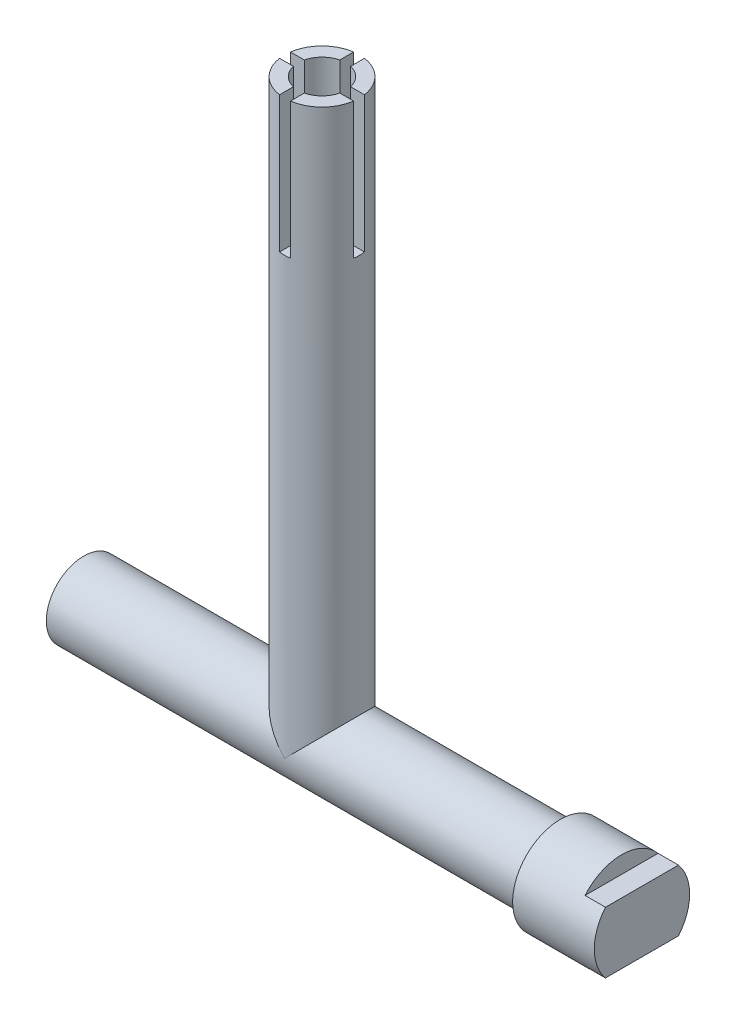
ISO-10303-21;
HEADER;
FILE_DESCRIPTION(('STEP AP214'),'2;1');
FILE_NAME('part.step','',(''),(''),'','','');
FILE_SCHEMA(('AUTOMOTIVE_DESIGN { 1 0 10303 214 1 1 1 1 }'));
ENDSEC;
DATA;
#1=APPLICATION_CONTEXT('core data for automotive mechanical design processes');
#2=APPLICATION_PROTOCOL_DEFINITION('international standard','automotive_design',2000,#1);
#3=PRODUCT_CONTEXT('',#1,'mechanical');
#4=PRODUCT('Part','Part','',(#3));
#5=PRODUCT_RELATED_PRODUCT_CATEGORY('part','',(#4));
#6=PRODUCT_DEFINITION_FORMATION('','',#4);
#7=PRODUCT_DEFINITION_CONTEXT('part definition',#1,'design');
#8=PRODUCT_DEFINITION('design','',#6,#7);
#9=PRODUCT_DEFINITION_SHAPE('','',#8);
#10=(LENGTH_UNIT() NAMED_UNIT(*) SI_UNIT(.MILLI.,.METRE.));
#11=(NAMED_UNIT(*) PLANE_ANGLE_UNIT() SI_UNIT($,.RADIAN.));
#12=(NAMED_UNIT(*) SI_UNIT($,.STERADIAN.) SOLID_ANGLE_UNIT());
#13=UNCERTAINTY_MEASURE_WITH_UNIT(LENGTH_MEASURE(1.E-05),#10,'distance_accuracy_value','');
#14=(GEOMETRIC_REPRESENTATION_CONTEXT(3) GLOBAL_UNCERTAINTY_ASSIGNED_CONTEXT((#13)) GLOBAL_UNIT_ASSIGNED_CONTEXT((#10,
#11,#12)) REPRESENTATION_CONTEXT('',''));
#15=CARTESIAN_POINT('',(0.,0.,0.));
#16=DIRECTION('',(0.,0.,1.));
#17=DIRECTION('',(1.,0.,0.));
#18=AXIS2_PLACEMENT_3D('',#15,#16,#17);
#19=CARTESIAN_POINT('',(41.,0.,0.));
#20=DIRECTION('',(-1.,0.,0.));
#21=DIRECTION('',(0.,0.,1.));
#22=AXIS2_PLACEMENT_3D('',#19,#20,#21);
#23=CYLINDRICAL_SURFACE('',#22,3.5);
#24=CARTESIAN_POINT('',(35.,0.,0.));
#25=DIRECTION('',(1.,0.,0.));
#26=DIRECTION('',(0.,0.,-1.));
#27=AXIS2_PLACEMENT_3D('',#24,#25,#26);
#28=CIRCLE('',#27,3.5);
#29=CARTESIAN_POINT('',(35.,0.,-3.5));
#30=VERTEX_POINT('',#29);
#31=EDGE_CURVE('E229',#30,#30,#28,.T.);
#32=ORIENTED_EDGE('',*,*,#31,.T.);
#33=EDGE_LOOP('',(#32));
#34=FACE_BOUND('',#33,.T.);
#35=DIRECTION('',(1.,0.,0.));
#36=VECTOR('',#35,1.);
#37=CARTESIAN_POINT('',(39.5,-2.25,2.6809513236909));
#38=LINE('',#37,#36);
#39=CARTESIAN_POINT('',(39.5,-2.25,2.6809513236909));
#40=VERTEX_POINT('',#39);
#41=CARTESIAN_POINT('',(41.,-2.25,2.6809513236909));
#42=VERTEX_POINT('',#41);
#43=EDGE_CURVE('E214',#40,#42,#38,.T.);
#44=ORIENTED_EDGE('',*,*,#43,.T.);
#45=CARTESIAN_POINT('',(41.,0.,0.));
#46=DIRECTION('',(1.,0.,0.));
#47=DIRECTION('',(0.,0.,-1.));
#48=AXIS2_PLACEMENT_3D('',#45,#46,#47);
#49=CIRCLE('',#48,3.5);
#50=CARTESIAN_POINT('',(41.,2.25,2.6809513236909));
#51=VERTEX_POINT('',#50);
#52=EDGE_CURVE('E231',#51,#42,#49,.T.);
#53=ORIENTED_EDGE('',*,*,#52,.F.);
#54=DIRECTION('',(1.,0.,0.));
#55=VECTOR('',#54,1.);
#56=CARTESIAN_POINT('',(39.5,2.25,2.6809513236909));
#57=LINE('',#56,#55);
#58=CARTESIAN_POINT('',(39.5,2.25,2.6809513236909));
#59=VERTEX_POINT('',#58);
#60=EDGE_CURVE('E61',#59,#51,#57,.T.);
#61=ORIENTED_EDGE('',*,*,#60,.F.);
#62=CARTESIAN_POINT('',(39.5,0.,0.));
#63=DIRECTION('',(1.,0.,0.));
#64=DIRECTION('',(0.,0.,-1.));
#65=AXIS2_PLACEMENT_3D('',#62,#63,#64);
#66=CIRCLE('',#65,3.5);
#67=CARTESIAN_POINT('',(39.5,2.25,-2.6809513236909));
#68=VERTEX_POINT('',#67);
#69=EDGE_CURVE('E220',#68,#59,#66,.T.);
#70=ORIENTED_EDGE('',*,*,#69,.F.);
#71=DIRECTION('',(1.,0.,0.));
#72=VECTOR('',#71,1.);
#73=CARTESIAN_POINT('',(39.5,2.25,-2.6809513236909));
#74=LINE('',#73,#72);
#75=CARTESIAN_POINT('',(41.,2.25,-2.6809513236909));
#76=VERTEX_POINT('',#75);
#77=EDGE_CURVE('E226',#68,#76,#74,.T.);
#78=ORIENTED_EDGE('',*,*,#77,.T.);
#79=CARTESIAN_POINT('',(41.,-2.25,-2.6809513236909));
#80=VERTEX_POINT('',#79);
#81=EDGE_CURVE('E235',#80,#76,#49,.T.);
#82=ORIENTED_EDGE('',*,*,#81,.F.);
#83=DIRECTION('',(1.,0.,0.));
#84=VECTOR('',#83,1.);
#85=CARTESIAN_POINT('',(39.5,-2.25,-2.6809513236909));
#86=LINE('',#85,#84);
#87=CARTESIAN_POINT('',(39.5,-2.25,-2.6809513236909));
#88=VERTEX_POINT('',#87);
#89=EDGE_CURVE('E53',#88,#80,#86,.T.);
#90=ORIENTED_EDGE('',*,*,#89,.F.);
#91=CARTESIAN_POINT('',(39.5,0.,0.));
#92=DIRECTION('',(1.,0.,0.));
#93=DIRECTION('',(0.,0.,-1.));
#94=AXIS2_PLACEMENT_3D('',#91,#92,#93);
#95=CIRCLE('',#94,3.5);
#96=EDGE_CURVE('E211',#40,#88,#95,.T.);
#97=ORIENTED_EDGE('',*,*,#96,.F.);
#98=EDGE_LOOP('',(#44,#53,#61,#70,#78,#82,#90,#97));
#99=FACE_BOUND('',#98,.T.);
#100=ADVANCED_FACE('F38',(#34,#99),#23,.T.);
#101=CARTESIAN_POINT('',(41.,0.,0.));
#102=DIRECTION('',(1.,0.,0.));
#103=DIRECTION('',(0.,0.,-1.));
#104=AXIS2_PLACEMENT_3D('',#101,#102,#103);
#105=PLANE('',#104);
#106=ORIENTED_EDGE('',*,*,#52,.T.);
#107=DIRECTION('',(0.,0.,-1.));
#108=VECTOR('',#107,1.);
#109=CARTESIAN_POINT('',(41.,-2.25,0.));
#110=LINE('',#109,#108);
#111=EDGE_CURVE('E207',#42,#80,#110,.T.);
#112=ORIENTED_EDGE('',*,*,#111,.T.);
#113=ORIENTED_EDGE('',*,*,#81,.T.);
#114=DIRECTION('',(0.,0.,-1.));
#115=VECTOR('',#114,1.);
#116=CARTESIAN_POINT('',(41.,2.25,0.));
#117=LINE('',#116,#115);
#118=EDGE_CURVE('E217',#51,#76,#117,.T.);
#119=ORIENTED_EDGE('',*,*,#118,.F.);
#120=EDGE_LOOP('',(#106,#112,#113,#119));
#121=FACE_BOUND('',#120,.T.);
#122=ADVANCED_FACE('F428',(#121),#105,.T.);
#123=CARTESIAN_POINT('',(17.5,42.,0.));
#124=DIRECTION('',(0.,-1.,0.));
#125=DIRECTION('',(0.,0.,-1.));
#126=AXIS2_PLACEMENT_3D('',#123,#124,#125);
#127=CYLINDRICAL_SURFACE('',#126,2.75);
#128=CARTESIAN_POINT('',(17.5,0.,0.));
#129=DIRECTION('',(-0.707106781186548,0.707106781186547,0.));
#130=DIRECTION('',(-0.707106781186548,-0.707106781186547,0.));
#131=AXIS2_PLACEMENT_3D('',#128,#129,#130);
#132=ELLIPSE('',#131,3.88908729652601,2.75);
#133=CARTESIAN_POINT('',(17.5,0.,2.75));
#134=VERTEX_POINT('',#133);
#135=CARTESIAN_POINT('',(17.5,0.,-2.75));
#136=VERTEX_POINT('',#135);
#137=EDGE_CURVE('E320',#134,#136,#132,.T.);
#138=ORIENTED_EDGE('',*,*,#137,.T.);
#139=CARTESIAN_POINT('',(17.5,0.,0.));
#140=DIRECTION('',(-0.707106781186548,-0.707106781186547,0.));
#141=DIRECTION('',(-0.707106781186548,0.707106781186547,0.));
#142=AXIS2_PLACEMENT_3D('',#139,#140,#141);
#143=ELLIPSE('',#142,3.88908729652601,2.75);
#144=EDGE_CURVE('E325',#136,#134,#143,.F.);
#145=ORIENTED_EDGE('',*,*,#144,.T.);
#146=EDGE_LOOP('',(#138,#145));
#147=FACE_BOUND('',#146,.T.);
#148=DIRECTION('',(0.,-1.,0.));
#149=VECTOR('',#148,1.);
#150=CARTESIAN_POINT('',(20.2207535720826,42.,-0.400000000000001));
#151=LINE('',#150,#149);
#152=CARTESIAN_POINT('',(20.2207535720826,32.,-0.400000000000018));
#153=VERTEX_POINT('',#152);
#154=CARTESIAN_POINT('',(20.2207535720826,42.,-0.400000000000001));
#155=VERTEX_POINT('',#154);
#156=EDGE_CURVE('E296',#153,#155,#151,.F.);
#157=ORIENTED_EDGE('',*,*,#156,.F.);
#158=CARTESIAN_POINT('',(17.5,32.,0.));
#159=DIRECTION('',(0.,1.,0.));
#160=DIRECTION('',(0.,0.,1.));
#161=AXIS2_PLACEMENT_3D('',#158,#159,#160);
#162=CIRCLE('',#161,2.75);
#163=CARTESIAN_POINT('',(20.2207535720826,32.,0.39999999999998));
#164=VERTEX_POINT('',#163);
#165=EDGE_CURVE('E282',#164,#153,#162,.T.);
#166=ORIENTED_EDGE('',*,*,#165,.F.);
#167=DIRECTION('',(0.,-1.,0.));
#168=VECTOR('',#167,1.);
#169=CARTESIAN_POINT('',(20.2207535720826,42.,0.399999999999998));
#170=LINE('',#169,#168);
#171=CARTESIAN_POINT('',(20.2207535720826,42.,0.399999999999998));
#172=VERTEX_POINT('',#171);
#173=EDGE_CURVE('E293',#164,#172,#170,.F.);
#174=ORIENTED_EDGE('',*,*,#173,.T.);
#175=CARTESIAN_POINT('',(17.5,42.,0.));
#176=DIRECTION('',(0.,1.,0.));
#177=DIRECTION('',(0.,0.,1.));
#178=AXIS2_PLACEMENT_3D('',#175,#176,#177);
#179=CIRCLE('',#178,2.75);
#180=CARTESIAN_POINT('',(17.9,42.0000000000001,2.72075357208256));
#181=VERTEX_POINT('',#180);
#182=EDGE_CURVE('E312',#181,#172,#179,.T.);
#183=ORIENTED_EDGE('',*,*,#182,.F.);
#184=DIRECTION('',(0.,-1.,0.));
#185=VECTOR('',#184,1.);
#186=CARTESIAN_POINT('',(17.9,42.0000000000001,2.72075357208255));
#187=LINE('',#186,#185);
#188=CARTESIAN_POINT('',(17.9,32.0000000000001,2.72075357208256));
#189=VERTEX_POINT('',#188);
#190=EDGE_CURVE('E290',#181,#189,#187,.T.);
#191=ORIENTED_EDGE('',*,*,#190,.T.);
#192=CARTESIAN_POINT('',(17.1,32.0000000000001,2.72075357208256));
#193=VERTEX_POINT('',#192);
#194=EDGE_CURVE('E261',#193,#189,#162,.T.);
#195=ORIENTED_EDGE('',*,*,#194,.F.);
#196=DIRECTION('',(0.,-1.,0.));
#197=VECTOR('',#196,1.);
#198=CARTESIAN_POINT('',(17.1,42.,2.72075357208255));
#199=LINE('',#198,#197);
#200=CARTESIAN_POINT('',(17.1,42.,2.72075357208255));
#201=VERTEX_POINT('',#200);
#202=EDGE_CURVE('E288',#201,#193,#199,.T.);
#203=ORIENTED_EDGE('',*,*,#202,.F.);
#204=CARTESIAN_POINT('',(14.7792464279174,42.0000000000001,0.399999999999998));
#205=VERTEX_POINT('',#204);
#206=EDGE_CURVE('E311',#205,#201,#179,.T.);
#207=ORIENTED_EDGE('',*,*,#206,.F.);
#208=DIRECTION('',(0.,-1.,0.));
#209=VECTOR('',#208,1.);
#210=CARTESIAN_POINT('',(14.7792464279174,42.0000000000001,0.399999999999998));
#211=LINE('',#210,#209);
#212=CARTESIAN_POINT('',(14.7792464279174,32.,0.39999999999998));
#213=VERTEX_POINT('',#212);
#214=EDGE_CURVE('E285',#205,#213,#211,.T.);
#215=ORIENTED_EDGE('',*,*,#214,.T.);
#216=CARTESIAN_POINT('',(14.7792464279174,32.,-0.400000000000018));
#217=VERTEX_POINT('',#216);
#218=EDGE_CURVE('E281',#217,#213,#162,.T.);
#219=ORIENTED_EDGE('',*,*,#218,.F.);
#220=DIRECTION('',(0.,-1.,0.));
#221=VECTOR('',#220,1.);
#222=CARTESIAN_POINT('',(14.7792464279174,42.0000000000001,-0.400000000000001));
#223=LINE('',#222,#221);
#224=CARTESIAN_POINT('',(14.7792464279174,42.0000000000001,-0.400000000000001));
#225=VERTEX_POINT('',#224);
#226=EDGE_CURVE('E283',#225,#217,#223,.T.);
#227=ORIENTED_EDGE('',*,*,#226,.F.);
#228=CARTESIAN_POINT('',(17.1,42.,-2.72075357208255));
#229=VERTEX_POINT('',#228);
#230=EDGE_CURVE('E395',#229,#225,#179,.T.);
#231=ORIENTED_EDGE('',*,*,#230,.F.);
#232=DIRECTION('',(0.,-1.,0.));
#233=VECTOR('',#232,1.);
#234=CARTESIAN_POINT('',(17.1,42.,-2.72075357208255));
#235=LINE('',#234,#233);
#236=CARTESIAN_POINT('',(17.1,32.,-2.72075357208256));
#237=VERTEX_POINT('',#236);
#238=EDGE_CURVE('E301',#237,#229,#235,.F.);
#239=ORIENTED_EDGE('',*,*,#238,.F.);
#240=CARTESIAN_POINT('',(17.9,32.,-2.72075357208256));
#241=VERTEX_POINT('',#240);
#242=EDGE_CURVE('E380',#241,#237,#162,.T.);
#243=ORIENTED_EDGE('',*,*,#242,.F.);
#244=DIRECTION('',(0.,-1.,0.));
#245=VECTOR('',#244,1.);
#246=CARTESIAN_POINT('',(17.9,42.0000000000001,-2.72075357208255));
#247=LINE('',#246,#245);
#248=CARTESIAN_POINT('',(17.9,42.0000000000001,-2.72075357208255));
#249=VERTEX_POINT('',#248);
#250=EDGE_CURVE('E298',#241,#249,#247,.F.);
#251=ORIENTED_EDGE('',*,*,#250,.T.);
#252=EDGE_CURVE('E316',#155,#249,#179,.T.);
#253=ORIENTED_EDGE('',*,*,#252,.F.);
#254=EDGE_LOOP('',(#157,#166,#174,#183,#191,#195,#203,#207,#215,#219,#227,#231,#239,#243,#251,#253));
#255=FACE_BOUND('',#254,.T.);
#256=ADVANCED_FACE('F378',(#147,#255),#127,.T.);
#257=CARTESIAN_POINT('',(17.5,42.,0.));
#258=DIRECTION('',(0.,1.,0.));
#259=DIRECTION('',(0.,0.,1.));
#260=AXIS2_PLACEMENT_3D('',#257,#258,#259);
#261=PLANE('',#260);
#262=CARTESIAN_POINT('',(17.5,42.,0.));
#263=DIRECTION('',(0.,1.,0.));
#264=DIRECTION('',(0.,0.,1.));
#265=AXIS2_PLACEMENT_3D('',#262,#263,#264);
#266=CIRCLE('',#265,1.75);
#267=CARTESIAN_POINT('',(17.1,42.,-1.70367250374007));
#268=VERTEX_POINT('',#267);
#269=CARTESIAN_POINT('',(15.7963274962599,42.0000000000001,-0.400000000000001));
#270=VERTEX_POINT('',#269);
#271=EDGE_CURVE('E779',#268,#270,#266,.T.);
#272=ORIENTED_EDGE('',*,*,#271,.F.);
#273=DIRECTION('',(0.,0.,-1.));
#274=VECTOR('',#273,1.);
#275=CARTESIAN_POINT('',(17.1,42.,0.));
#276=LINE('',#275,#274);
#277=EDGE_CURVE('E234',#268,#229,#276,.T.);
#278=ORIENTED_EDGE('',*,*,#277,.T.);
#279=ORIENTED_EDGE('',*,*,#230,.T.);
#280=DIRECTION('',(1.,0.,0.));
#281=VECTOR('',#280,1.);
#282=CARTESIAN_POINT('',(0.,42.,-0.400000000000015));
#283=LINE('',#282,#281);
#284=EDGE_CURVE('E264',#225,#270,#283,.T.);
#285=ORIENTED_EDGE('',*,*,#284,.T.);
#286=EDGE_LOOP('',(#272,#278,#279,#285));
#287=FACE_BOUND('',#286,.T.);
#288=ADVANCED_FACE('F482',(#287),#261,.T.);
#289=DIRECTION('',(0.,0.,-1.));
#290=VECTOR('',#289,1.);
#291=CARTESIAN_POINT('',(17.9,42.0000000000001,0.));
#292=LINE('',#291,#290);
#293=CARTESIAN_POINT('',(17.9,42.0000000000001,-1.70367250374008));
#294=VERTEX_POINT('',#293);
#295=EDGE_CURVE('E242',#294,#249,#292,.T.);
#296=ORIENTED_EDGE('',*,*,#295,.F.);
#297=CARTESIAN_POINT('',(19.2036725037401,42.,-0.400000000000001));
#298=VERTEX_POINT('',#297);
#299=EDGE_CURVE('E308',#298,#294,#266,.T.);
#300=ORIENTED_EDGE('',*,*,#299,.F.);
#301=DIRECTION('',(1.,0.,0.));
#302=VECTOR('',#301,1.);
#303=CARTESIAN_POINT('',(0.,42.,-0.400000000000015));
#304=LINE('',#303,#302);
#305=EDGE_CURVE('E276',#298,#155,#304,.T.);
#306=ORIENTED_EDGE('',*,*,#305,.T.);
#307=ORIENTED_EDGE('',*,*,#252,.T.);
#308=EDGE_LOOP('',(#296,#300,#306,#307));
#309=FACE_BOUND('',#308,.T.);
#310=ADVANCED_FACE('F402',(#309),#261,.T.);
#311=ORIENTED_EDGE('',*,*,#206,.T.);
#312=DIRECTION('',(0.,0.,-1.));
#313=VECTOR('',#312,1.);
#314=CARTESIAN_POINT('',(17.1,42.,0.));
#315=LINE('',#314,#313);
#316=CARTESIAN_POINT('',(17.1,42.,1.70367250374008));
#317=VERTEX_POINT('',#316);
#318=EDGE_CURVE('E269',#201,#317,#315,.T.);
#319=ORIENTED_EDGE('',*,*,#318,.T.);
#320=CARTESIAN_POINT('',(15.7963274962599,42.0000000000001,0.399999999999998));
#321=VERTEX_POINT('',#320);
#322=EDGE_CURVE('E303',#321,#317,#266,.T.);
#323=ORIENTED_EDGE('',*,*,#322,.F.);
#324=DIRECTION('',(1.,0.,0.));
#325=VECTOR('',#324,1.);
#326=CARTESIAN_POINT('',(0.,42.,0.399999999999984));
#327=LINE('',#326,#325);
#328=EDGE_CURVE('E267',#205,#321,#327,.T.);
#329=ORIENTED_EDGE('',*,*,#328,.F.);
#330=EDGE_LOOP('',(#311,#319,#323,#329));
#331=FACE_BOUND('',#330,.T.);
#332=ADVANCED_FACE('F491',(#331),#261,.T.);
#333=CARTESIAN_POINT('',(17.5,42.,0.));
#334=DIRECTION('',(0.,1.,0.));
#335=DIRECTION('',(0.,0.,1.));
#336=AXIS2_PLACEMENT_3D('',#333,#334,#335);
#337=CYLINDRICAL_SURFACE('',#336,1.75);
#338=CARTESIAN_POINT('',(17.5,32.,0.));
#339=DIRECTION('',(0.,1.,0.));
#340=DIRECTION('',(0.,0.,1.));
#341=AXIS2_PLACEMENT_3D('',#338,#339,#340);
#342=CIRCLE('',#341,1.75);
#343=CARTESIAN_POINT('',(15.7963274962599,32.,0.39999999999998));
#344=VERTEX_POINT('',#343);
#345=CARTESIAN_POINT('',(15.7963274962599,32.,-0.400000000000018));
#346=VERTEX_POINT('',#345);
#347=EDGE_CURVE('E331',#344,#346,#342,.F.);
#348=ORIENTED_EDGE('',*,*,#347,.F.);
#349=DIRECTION('',(0.,1.,0.));
#350=VECTOR('',#349,1.);
#351=CARTESIAN_POINT('',(15.7963274962599,42.0000000000001,0.399999999999998));
#352=LINE('',#351,#350);
#353=EDGE_CURVE('E11',#344,#321,#352,.T.);
#354=ORIENTED_EDGE('',*,*,#353,.T.);
#355=ORIENTED_EDGE('',*,*,#322,.T.);
#356=DIRECTION('',(0.,1.,0.));
#357=VECTOR('',#356,1.);
#358=CARTESIAN_POINT('',(17.1,42.,1.70367250374008));
#359=LINE('',#358,#357);
#360=CARTESIAN_POINT('',(17.1,32.,1.70367250374008));
#361=VERTEX_POINT('',#360);
#362=EDGE_CURVE('E330',#361,#317,#359,.T.);
#363=ORIENTED_EDGE('',*,*,#362,.F.);
#364=CARTESIAN_POINT('',(17.9,32.,1.70367250374008));
#365=VERTEX_POINT('',#364);
#366=EDGE_CURVE('E328',#365,#361,#342,.F.);
#367=ORIENTED_EDGE('',*,*,#366,.F.);
#368=DIRECTION('',(0.,1.,0.));
#369=VECTOR('',#368,1.);
#370=CARTESIAN_POINT('',(17.9,42.0000000000001,1.70367250374008));
#371=LINE('',#370,#369);
#372=CARTESIAN_POINT('',(17.9,42.0000000000001,1.70367250374008));
#373=VERTEX_POINT('',#372);
#374=EDGE_CURVE('E334',#365,#373,#371,.T.);
#375=ORIENTED_EDGE('',*,*,#374,.T.);
#376=CARTESIAN_POINT('',(19.2036725037401,42.,0.399999999999998));
#377=VERTEX_POINT('',#376);
#378=EDGE_CURVE('E304',#373,#377,#266,.T.);
#379=ORIENTED_EDGE('',*,*,#378,.T.);
#380=DIRECTION('',(0.,1.,0.));
#381=VECTOR('',#380,1.);
#382=CARTESIAN_POINT('',(19.2036725037401,42.,0.399999999999998));
#383=LINE('',#382,#381);
#384=CARTESIAN_POINT('',(19.2036725037401,32.,0.39999999999998));
#385=VERTEX_POINT('',#384);
#386=EDGE_CURVE('E337',#377,#385,#383,.F.);
#387=ORIENTED_EDGE('',*,*,#386,.T.);
#388=CARTESIAN_POINT('',(19.2036725037401,32.,-0.400000000000018));
#389=VERTEX_POINT('',#388);
#390=EDGE_CURVE('E332',#389,#385,#342,.F.);
#391=ORIENTED_EDGE('',*,*,#390,.F.);
#392=DIRECTION('',(0.,1.,0.));
#393=VECTOR('',#392,1.);
#394=CARTESIAN_POINT('',(19.2036725037401,42.,-0.400000000000001));
#395=LINE('',#394,#393);
#396=EDGE_CURVE('E340',#298,#389,#395,.F.);
#397=ORIENTED_EDGE('',*,*,#396,.F.);
#398=ORIENTED_EDGE('',*,*,#299,.T.);
#399=DIRECTION('',(0.,1.,0.));
#400=VECTOR('',#399,1.);
#401=CARTESIAN_POINT('',(17.9,42.0000000000001,-1.70367250374008));
#402=LINE('',#401,#400);
#403=CARTESIAN_POINT('',(17.9,32.,-1.70367250374008));
#404=VERTEX_POINT('',#403);
#405=EDGE_CURVE('E344',#294,#404,#402,.F.);
#406=ORIENTED_EDGE('',*,*,#405,.T.);
#407=CARTESIAN_POINT('',(17.1,32.,-1.70367250374008));
#408=VERTEX_POINT('',#407);
#409=EDGE_CURVE('E343',#408,#404,#342,.F.);
#410=ORIENTED_EDGE('',*,*,#409,.F.);
#411=DIRECTION('',(0.,1.,0.));
#412=VECTOR('',#411,1.);
#413=CARTESIAN_POINT('',(17.1,42.,-1.70367250374007));
#414=LINE('',#413,#412);
#415=EDGE_CURVE('E347',#268,#408,#414,.F.);
#416=ORIENTED_EDGE('',*,*,#415,.F.);
#417=ORIENTED_EDGE('',*,*,#271,.T.);
#418=DIRECTION('',(0.,1.,0.));
#419=VECTOR('',#418,1.);
#420=CARTESIAN_POINT('',(15.7963274962599,42.0000000000001,-0.400000000000001));
#421=LINE('',#420,#419);
#422=EDGE_CURVE('E46',#346,#270,#421,.T.);
#423=ORIENTED_EDGE('',*,*,#422,.F.);
#424=EDGE_LOOP('',(#348,#354,#355,#363,#367,#375,#379,#387,#391,#397,#398,#406,#410,#416,#417,#423));
#425=FACE_BOUND('',#424,.T.);
#426=CARTESIAN_POINT('',(17.5,28.9999999999999,0.));
#427=DIRECTION('',(0.,1.,0.));
#428=DIRECTION('',(0.,0.,1.));
#429=AXIS2_PLACEMENT_3D('',#426,#427,#428);
#430=CIRCLE('',#429,1.75);
#431=CARTESIAN_POINT('',(17.5,28.9999999999999,1.75));
#432=VERTEX_POINT('',#431);
#433=EDGE_CURVE('E307',#432,#432,#430,.T.);
#434=ORIENTED_EDGE('',*,*,#433,.F.);
#435=EDGE_LOOP('',(#434));
#436=FACE_BOUND('',#435,.T.);
#437=ADVANCED_FACE('F367',(#425,#436),#337,.F.);
#438=CARTESIAN_POINT('',(35.,0.,0.));
#439=DIRECTION('',(-1.,0.,0.));
#440=DIRECTION('',(0.,0.,1.));
#441=AXIS2_PLACEMENT_3D('',#438,#439,#440);
#442=CYLINDRICAL_SURFACE('',#441,2.75);
#443=CARTESIAN_POINT('',(0.,0.,0.));
#444=DIRECTION('',(1.,0.,0.));
#445=DIRECTION('',(0.,0.,-1.));
#446=AXIS2_PLACEMENT_3D('',#443,#444,#445);
#447=CIRCLE('',#446,2.75);
#448=CARTESIAN_POINT('',(0.,0.,-2.75));
#449=VERTEX_POINT('',#448);
#450=EDGE_CURVE('E315',#449,#449,#447,.T.);
#451=ORIENTED_EDGE('',*,*,#450,.T.);
#452=EDGE_LOOP('',(#451));
#453=FACE_BOUND('',#452,.T.);
#454=CARTESIAN_POINT('',(35.,0.,0.));
#455=DIRECTION('',(1.,0.,0.));
#456=DIRECTION('',(0.,0.,-1.));
#457=AXIS2_PLACEMENT_3D('',#454,#455,#456);
#458=CIRCLE('',#457,2.75);
#459=CARTESIAN_POINT('',(35.,0.,-2.75));
#460=VERTEX_POINT('',#459);
#461=EDGE_CURVE('E317',#460,#460,#458,.T.);
#462=ORIENTED_EDGE('',*,*,#461,.F.);
#463=EDGE_LOOP('',(#462));
#464=FACE_BOUND('',#463,.T.);
#465=ORIENTED_EDGE('',*,*,#144,.F.);
#466=ORIENTED_EDGE('',*,*,#137,.F.);
#467=EDGE_LOOP('',(#465,#466));
#468=FACE_BOUND('',#467,.T.);
#469=ADVANCED_FACE('F40',(#453,#464,#468),#442,.T.);
#470=CARTESIAN_POINT('',(0.,0.,0.));
#471=DIRECTION('',(1.,0.,0.));
#472=DIRECTION('',(0.,0.,-1.));
#473=AXIS2_PLACEMENT_3D('',#470,#471,#472);
#474=PLANE('',#473);
#475=CARTESIAN_POINT('',(0.,0.,0.));
#476=DIRECTION('',(-1.,0.,0.));
#477=DIRECTION('',(0.,0.,1.));
#478=AXIS2_PLACEMENT_3D('',#475,#476,#477);
#479=CIRCLE('',#478,2.);
#480=CARTESIAN_POINT('',(0.,0.,2.));
#481=VERTEX_POINT('',#480);
#482=EDGE_CURVE('E197',#481,#481,#479,.T.);
#483=ORIENTED_EDGE('',*,*,#482,.F.);
#484=EDGE_LOOP('',(#483));
#485=FACE_BOUND('',#484,.T.);
#486=ORIENTED_EDGE('',*,*,#450,.F.);
#487=EDGE_LOOP('',(#486));
#488=FACE_BOUND('',#487,.T.);
#489=ADVANCED_FACE('F471',(#485,#488),#474,.F.);
#490=DIRECTION('',(1.,0.,0.));
#491=VECTOR('',#490,1.);
#492=CARTESIAN_POINT('',(0.,42.,0.399999999999984));
#493=LINE('',#492,#491);
#494=EDGE_CURVE('E274',#377,#172,#493,.T.);
#495=ORIENTED_EDGE('',*,*,#494,.F.);
#496=ORIENTED_EDGE('',*,*,#378,.F.);
#497=DIRECTION('',(0.,0.,-1.));
#498=VECTOR('',#497,1.);
#499=CARTESIAN_POINT('',(17.9,42.0000000000001,0.));
#500=LINE('',#499,#498);
#501=EDGE_CURVE('E272',#181,#373,#500,.T.);
#502=ORIENTED_EDGE('',*,*,#501,.F.);
#503=ORIENTED_EDGE('',*,*,#182,.T.);
#504=EDGE_LOOP('',(#495,#496,#502,#503));
#505=FACE_BOUND('',#504,.T.);
#506=ADVANCED_FACE('F374',(#505),#261,.T.);
#507=CARTESIAN_POINT('',(17.5,28.9999999999999,0.));
#508=DIRECTION('',(0.,1.,0.));
#509=DIRECTION('',(0.,0.,1.));
#510=AXIS2_PLACEMENT_3D('',#507,#508,#509);
#511=CONICAL_SURFACE('',#510,1.75,1.02974425867665);
#512=CARTESIAN_POINT('',(17.5,27.9484939167017,0.));
#513=VERTEX_POINT('',#512);
#514=VERTEX_LOOP('',#513);
#515=FACE_BOUND('',#514,.T.);
#516=ORIENTED_EDGE('',*,*,#433,.T.);
#517=EDGE_LOOP('',(#516));
#518=FACE_BOUND('',#517,.T.);
#519=ADVANCED_FACE('F490',(#515,#518),#511,.F.);
#520=CARTESIAN_POINT('',(0.,32.,0.));
#521=DIRECTION('',(0.,1.,0.));
#522=DIRECTION('',(0.,0.,1.));
#523=AXIS2_PLACEMENT_3D('',#520,#521,#522);
#524=PLANE('',#523);
#525=ORIENTED_EDGE('',*,*,#194,.T.);
#526=DIRECTION('',(0.,0.,-1.));
#527=VECTOR('',#526,1.);
#528=CARTESIAN_POINT('',(17.9,32.,0.));
#529=LINE('',#528,#527);
#530=EDGE_CURVE('E250',#189,#365,#529,.T.);
#531=ORIENTED_EDGE('',*,*,#530,.T.);
#532=ORIENTED_EDGE('',*,*,#366,.T.);
#533=DIRECTION('',(0.,0.,-1.));
#534=VECTOR('',#533,1.);
#535=CARTESIAN_POINT('',(17.1,32.,0.));
#536=LINE('',#535,#534);
#537=EDGE_CURVE('E247',#193,#361,#536,.T.);
#538=ORIENTED_EDGE('',*,*,#537,.F.);
#539=EDGE_LOOP('',(#525,#531,#532,#538));
#540=FACE_BOUND('',#539,.T.);
#541=ADVANCED_FACE('F424',(#540),#524,.T.);
#542=CARTESIAN_POINT('',(17.1,32.,0.));
#543=DIRECTION('',(1.,0.,0.));
#544=DIRECTION('',(0.,0.,-1.));
#545=AXIS2_PLACEMENT_3D('',#542,#543,#544);
#546=PLANE('',#545);
#547=ORIENTED_EDGE('',*,*,#202,.T.);
#548=ORIENTED_EDGE('',*,*,#537,.T.);
#549=ORIENTED_EDGE('',*,*,#362,.T.);
#550=ORIENTED_EDGE('',*,*,#318,.F.);
#551=EDGE_LOOP('',(#547,#548,#549,#550));
#552=FACE_BOUND('',#551,.T.);
#553=ADVANCED_FACE('F504',(#552),#546,.T.);
#554=CARTESIAN_POINT('',(17.9,32.,0.));
#555=DIRECTION('',(1.,0.,0.));
#556=DIRECTION('',(0.,0.,-1.));
#557=AXIS2_PLACEMENT_3D('',#554,#555,#556);
#558=PLANE('',#557);
#559=ORIENTED_EDGE('',*,*,#501,.T.);
#560=ORIENTED_EDGE('',*,*,#374,.F.);
#561=ORIENTED_EDGE('',*,*,#530,.F.);
#562=ORIENTED_EDGE('',*,*,#190,.F.);
#563=EDGE_LOOP('',(#559,#560,#561,#562));
#564=FACE_BOUND('',#563,.T.);
#565=ADVANCED_FACE('F426',(#564),#558,.F.);
#566=ORIENTED_EDGE('',*,*,#165,.T.);
#567=DIRECTION('',(1.,0.,0.));
#568=VECTOR('',#567,1.);
#569=CARTESIAN_POINT('',(0.,32.,-0.400000000000018));
#570=LINE('',#569,#568);
#571=EDGE_CURVE('E255',#389,#153,#570,.T.);
#572=ORIENTED_EDGE('',*,*,#571,.F.);
#573=ORIENTED_EDGE('',*,*,#390,.T.);
#574=DIRECTION('',(1.,0.,0.));
#575=VECTOR('',#574,1.);
#576=CARTESIAN_POINT('',(0.,32.,0.39999999999998));
#577=LINE('',#576,#575);
#578=EDGE_CURVE('E252',#385,#164,#577,.T.);
#579=ORIENTED_EDGE('',*,*,#578,.T.);
#580=EDGE_LOOP('',(#566,#572,#573,#579));
#581=FACE_BOUND('',#580,.T.);
#582=ADVANCED_FACE('F360',(#581),#524,.T.);
#583=CARTESIAN_POINT('',(0.,32.,0.39999999999998));
#584=DIRECTION('',(0.,0.,1.));
#585=DIRECTION('',(1.,0.,0.));
#586=AXIS2_PLACEMENT_3D('',#583,#584,#585);
#587=PLANE('',#586);
#588=ORIENTED_EDGE('',*,*,#578,.F.);
#589=ORIENTED_EDGE('',*,*,#386,.F.);
#590=ORIENTED_EDGE('',*,*,#494,.T.);
#591=ORIENTED_EDGE('',*,*,#173,.F.);
#592=EDGE_LOOP('',(#588,#589,#590,#591));
#593=FACE_BOUND('',#592,.T.);
#594=ADVANCED_FACE('F365',(#593),#587,.F.);
#595=CARTESIAN_POINT('',(0.,32.,-0.400000000000018));
#596=DIRECTION('',(0.,0.,1.));
#597=DIRECTION('',(1.,0.,0.));
#598=AXIS2_PLACEMENT_3D('',#595,#596,#597);
#599=PLANE('',#598);
#600=ORIENTED_EDGE('',*,*,#156,.T.);
#601=ORIENTED_EDGE('',*,*,#305,.F.);
#602=ORIENTED_EDGE('',*,*,#396,.T.);
#603=ORIENTED_EDGE('',*,*,#571,.T.);
#604=EDGE_LOOP('',(#600,#601,#602,#603));
#605=FACE_BOUND('',#604,.T.);
#606=ADVANCED_FACE('F410',(#605),#599,.T.);
#607=ORIENTED_EDGE('',*,*,#242,.T.);
#608=DIRECTION('',(0.,0.,-1.));
#609=VECTOR('',#608,1.);
#610=CARTESIAN_POINT('',(17.1,32.,0.));
#611=LINE('',#610,#609);
#612=EDGE_CURVE('E238',#408,#237,#611,.T.);
#613=ORIENTED_EDGE('',*,*,#612,.F.);
#614=ORIENTED_EDGE('',*,*,#409,.T.);
#615=DIRECTION('',(0.,0.,-1.));
#616=VECTOR('',#615,1.);
#617=CARTESIAN_POINT('',(17.9,32.,0.));
#618=LINE('',#617,#616);
#619=EDGE_CURVE('E258',#404,#241,#618,.T.);
#620=ORIENTED_EDGE('',*,*,#619,.T.);
#621=EDGE_LOOP('',(#607,#613,#614,#620));
#622=FACE_BOUND('',#621,.T.);
#623=ADVANCED_FACE('F408',(#622),#524,.T.);
#624=CARTESIAN_POINT('',(17.9,32.,0.));
#625=DIRECTION('',(1.,0.,0.));
#626=DIRECTION('',(0.,0.,-1.));
#627=AXIS2_PLACEMENT_3D('',#624,#625,#626);
#628=PLANE('',#627);
#629=ORIENTED_EDGE('',*,*,#619,.F.);
#630=ORIENTED_EDGE('',*,*,#405,.F.);
#631=ORIENTED_EDGE('',*,*,#295,.T.);
#632=ORIENTED_EDGE('',*,*,#250,.F.);
#633=EDGE_LOOP('',(#629,#630,#631,#632));
#634=FACE_BOUND('',#633,.T.);
#635=ADVANCED_FACE('F407',(#634),#628,.F.);
#636=CARTESIAN_POINT('',(17.1,32.,0.));
#637=DIRECTION('',(1.,0.,0.));
#638=DIRECTION('',(0.,0.,-1.));
#639=AXIS2_PLACEMENT_3D('',#636,#637,#638);
#640=PLANE('',#639);
#641=ORIENTED_EDGE('',*,*,#238,.T.);
#642=ORIENTED_EDGE('',*,*,#277,.F.);
#643=ORIENTED_EDGE('',*,*,#415,.T.);
#644=ORIENTED_EDGE('',*,*,#612,.T.);
#645=EDGE_LOOP('',(#641,#642,#643,#644));
#646=FACE_BOUND('',#645,.T.);
#647=ADVANCED_FACE('F416',(#646),#640,.T.);
#648=CARTESIAN_POINT('',(0.,32.,0.39999999999998));
#649=DIRECTION('',(0.,0.,1.));
#650=DIRECTION('',(1.,0.,0.));
#651=AXIS2_PLACEMENT_3D('',#648,#649,#650);
#652=PLANE('',#651);
#653=ORIENTED_EDGE('',*,*,#328,.T.);
#654=ORIENTED_EDGE('',*,*,#353,.F.);
#655=DIRECTION('',(1.,0.,0.));
#656=VECTOR('',#655,1.);
#657=CARTESIAN_POINT('',(0.,32.,0.39999999999998));
#658=LINE('',#657,#656);
#659=EDGE_CURVE('E245',#213,#344,#658,.T.);
#660=ORIENTED_EDGE('',*,*,#659,.F.);
#661=ORIENTED_EDGE('',*,*,#214,.F.);
#662=EDGE_LOOP('',(#653,#654,#660,#661));
#663=FACE_BOUND('',#662,.T.);
#664=ADVANCED_FACE('F388',(#663),#652,.F.);
#665=CARTESIAN_POINT('',(0.,32.,-0.400000000000018));
#666=DIRECTION('',(0.,0.,1.));
#667=DIRECTION('',(1.,0.,0.));
#668=AXIS2_PLACEMENT_3D('',#665,#666,#667);
#669=PLANE('',#668);
#670=ORIENTED_EDGE('',*,*,#226,.T.);
#671=DIRECTION('',(1.,0.,0.));
#672=VECTOR('',#671,1.);
#673=CARTESIAN_POINT('',(0.,32.,-0.400000000000018));
#674=LINE('',#673,#672);
#675=EDGE_CURVE('E241',#217,#346,#674,.T.);
#676=ORIENTED_EDGE('',*,*,#675,.T.);
#677=ORIENTED_EDGE('',*,*,#422,.T.);
#678=ORIENTED_EDGE('',*,*,#284,.F.);
#679=EDGE_LOOP('',(#670,#676,#677,#678));
#680=FACE_BOUND('',#679,.T.);
#681=ADVANCED_FACE('F423',(#680),#669,.T.);
#682=ORIENTED_EDGE('',*,*,#218,.T.);
#683=ORIENTED_EDGE('',*,*,#659,.T.);
#684=ORIENTED_EDGE('',*,*,#347,.T.);
#685=ORIENTED_EDGE('',*,*,#675,.F.);
#686=EDGE_LOOP('',(#682,#683,#684,#685));
#687=FACE_BOUND('',#686,.T.);
#688=ADVANCED_FACE('F384',(#687),#524,.T.);
#689=CARTESIAN_POINT('',(35.,0.,0.));
#690=DIRECTION('',(1.,0.,0.));
#691=DIRECTION('',(0.,0.,-1.));
#692=AXIS2_PLACEMENT_3D('',#689,#690,#691);
#693=PLANE('',#692);
#694=ORIENTED_EDGE('',*,*,#31,.F.);
#695=EDGE_LOOP('',(#694));
#696=FACE_BOUND('',#695,.T.);
#697=ORIENTED_EDGE('',*,*,#461,.T.);
#698=EDGE_LOOP('',(#697));
#699=FACE_BOUND('',#698,.T.);
#700=ADVANCED_FACE('F422',(#696,#699),#693,.F.);
#701=CARTESIAN_POINT('',(39.5,2.25,0.));
#702=DIRECTION('',(0.,-1.,0.));
#703=DIRECTION('',(0.,0.,-1.));
#704=AXIS2_PLACEMENT_3D('',#701,#702,#703);
#705=PLANE('',#704);
#706=ORIENTED_EDGE('',*,*,#118,.T.);
#707=ORIENTED_EDGE('',*,*,#77,.F.);
#708=DIRECTION('',(0.,0.,-1.));
#709=VECTOR('',#708,1.);
#710=CARTESIAN_POINT('',(39.5,2.25,0.));
#711=LINE('',#710,#709);
#712=EDGE_CURVE('E222',#59,#68,#711,.T.);
#713=ORIENTED_EDGE('',*,*,#712,.F.);
#714=ORIENTED_EDGE('',*,*,#60,.T.);
#715=EDGE_LOOP('',(#706,#707,#713,#714));
#716=FACE_BOUND('',#715,.T.);
#717=ADVANCED_FACE('F438',(#716),#705,.F.);
#718=CARTESIAN_POINT('',(39.5,0.,0.));
#719=DIRECTION('',(1.,0.,0.));
#720=DIRECTION('',(0.,0.,-1.));
#721=AXIS2_PLACEMENT_3D('',#718,#719,#720);
#722=PLANE('',#721);
#723=ORIENTED_EDGE('',*,*,#69,.T.);
#724=ORIENTED_EDGE('',*,*,#712,.T.);
#725=EDGE_LOOP('',(#723,#724));
#726=FACE_BOUND('',#725,.T.);
#727=ADVANCED_FACE('F443',(#726),#722,.T.);
#728=CARTESIAN_POINT('',(39.5,-2.25,0.));
#729=DIRECTION('',(0.,-1.,0.));
#730=DIRECTION('',(0.,0.,-1.));
#731=AXIS2_PLACEMENT_3D('',#728,#729,#730);
#732=PLANE('',#731);
#733=ORIENTED_EDGE('',*,*,#111,.F.);
#734=ORIENTED_EDGE('',*,*,#43,.F.);
#735=DIRECTION('',(0.,0.,-1.));
#736=VECTOR('',#735,1.);
#737=CARTESIAN_POINT('',(39.5,-2.25,0.));
#738=LINE('',#737,#736);
#739=EDGE_CURVE('E209',#40,#88,#738,.T.);
#740=ORIENTED_EDGE('',*,*,#739,.T.);
#741=ORIENTED_EDGE('',*,*,#89,.T.);
#742=EDGE_LOOP('',(#733,#734,#740,#741));
#743=FACE_BOUND('',#742,.T.);
#744=ADVANCED_FACE('F446',(#743),#732,.T.);
#745=CARTESIAN_POINT('',(39.5,0.,0.));
#746=DIRECTION('',(1.,0.,0.));
#747=DIRECTION('',(0.,0.,-1.));
#748=AXIS2_PLACEMENT_3D('',#745,#746,#747);
#749=PLANE('',#748);
#750=ORIENTED_EDGE('',*,*,#739,.F.);
#751=ORIENTED_EDGE('',*,*,#96,.T.);
#752=EDGE_LOOP('',(#750,#751));
#753=FACE_BOUND('',#752,.T.);
#754=ADVANCED_FACE('F450',(#753),#749,.T.);
#755=CARTESIAN_POINT('',(6.99999999999999,0.,0.));
#756=DIRECTION('',(-1.,0.,0.));
#757=DIRECTION('',(0.,0.,1.));
#758=AXIS2_PLACEMENT_3D('',#755,#756,#757);
#759=CYLINDRICAL_SURFACE('',#758,2.);
#760=CARTESIAN_POINT('',(6.99999999999999,0.,0.));
#761=DIRECTION('',(-1.,0.,0.));
#762=DIRECTION('',(0.,0.,1.));
#763=AXIS2_PLACEMENT_3D('',#760,#761,#762);
#764=CIRCLE('',#763,2.);
#765=CARTESIAN_POINT('',(6.99999999999999,0.,2.));
#766=VERTEX_POINT('',#765);
#767=EDGE_CURVE('E201',#766,#766,#764,.T.);
#768=ORIENTED_EDGE('',*,*,#767,.F.);
#769=EDGE_LOOP('',(#768));
#770=FACE_BOUND('',#769,.T.);
#771=ORIENTED_EDGE('',*,*,#482,.T.);
#772=EDGE_LOOP('',(#771));
#773=FACE_BOUND('',#772,.T.);
#774=ADVANCED_FACE('F453',(#770,#773),#759,.F.);
#775=CARTESIAN_POINT('',(6.99999999999999,0.,0.));
#776=DIRECTION('',(-1.,0.,0.));
#777=DIRECTION('',(0.,0.,1.));
#778=AXIS2_PLACEMENT_3D('',#775,#776,#777);
#779=PLANE('',#778);
#780=CARTESIAN_POINT('',(6.99999999999999,0.,0.));
#781=DIRECTION('',(-1.,0.,0.));
#782=DIRECTION('',(0.,0.,1.));
#783=AXIS2_PLACEMENT_3D('',#780,#781,#782);
#784=CIRCLE('',#783,1.025);
#785=CARTESIAN_POINT('',(6.99999999999999,0.,1.025));
#786=VERTEX_POINT('',#785);
#787=EDGE_CURVE('E198',#786,#786,#784,.T.);
#788=ORIENTED_EDGE('',*,*,#787,.F.);
#789=EDGE_LOOP('',(#788));
#790=FACE_BOUND('',#789,.T.);
#791=ORIENTED_EDGE('',*,*,#767,.T.);
#792=EDGE_LOOP('',(#791));
#793=FACE_BOUND('',#792,.T.);
#794=ADVANCED_FACE('F191',(#790,#793),#779,.T.);
#795=CARTESIAN_POINT('',(13.,0.,0.));
#796=DIRECTION('',(-1.,0.,0.));
#797=DIRECTION('',(0.,0.,1.));
#798=AXIS2_PLACEMENT_3D('',#795,#796,#797);
#799=CONICAL_SURFACE('',#798,1.025,1.02974425867665);
#800=CARTESIAN_POINT('',(13.6158821345032,0.,0.));
#801=VERTEX_POINT('',#800);
#802=VERTEX_LOOP('',#801);
#803=FACE_BOUND('',#802,.T.);
#804=CARTESIAN_POINT('',(13.,0.,0.));
#805=DIRECTION('',(-1.,0.,0.));
#806=DIRECTION('',(0.,0.,1.));
#807=AXIS2_PLACEMENT_3D('',#804,#805,#806);
#808=CIRCLE('',#807,1.025);
#809=CARTESIAN_POINT('',(13.,0.,1.025));
#810=VERTEX_POINT('',#809);
#811=EDGE_CURVE('E195',#810,#810,#808,.T.);
#812=ORIENTED_EDGE('',*,*,#811,.T.);
#813=EDGE_LOOP('',(#812));
#814=FACE_BOUND('',#813,.T.);
#815=ADVANCED_FACE('F187',(#803,#814),#799,.F.);
#816=CARTESIAN_POINT('',(6.99999999999999,0.,0.));
#817=DIRECTION('',(-1.,0.,0.));
#818=DIRECTION('',(0.,0.,1.));
#819=AXIS2_PLACEMENT_3D('',#816,#817,#818);
#820=CYLINDRICAL_SURFACE('',#819,1.025);
#821=ORIENTED_EDGE('',*,*,#811,.F.);
#822=EDGE_LOOP('',(#821));
#823=FACE_BOUND('',#822,.T.);
#824=ORIENTED_EDGE('',*,*,#787,.T.);
#825=EDGE_LOOP('',(#824));
#826=FACE_BOUND('',#825,.T.);
#827=ADVANCED_FACE('F190',(#823,#826),#820,.F.);
#828=CLOSED_SHELL('',(#100,#122,#256,#288,#310,#332,#437,#469,#489,#506,#519,#541,#553,#565,
#582,#594,#606,#623,#635,#647,#664,#681,#688,#700,#717,#727,#744,#754,#774,#794,#815,#827));
#829=MANIFOLD_SOLID_BREP('B2',#828);
#830=ADVANCED_BREP_SHAPE_REPRESENTATION('',(#18,#829),#14);
#831=SHAPE_DEFINITION_REPRESENTATION(#9,#830);
ENDSEC;
END-ISO-10303-21;
